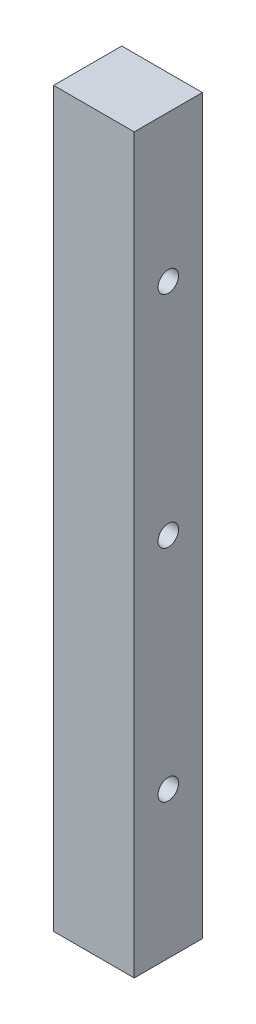
ISO-10303-21;
HEADER;
FILE_DESCRIPTION(('STEP AP214'),'2;1');
FILE_NAME('part.step','',(''),(''),'','','');
FILE_SCHEMA(('AUTOMOTIVE_DESIGN { 1 0 10303 214 1 1 1 1 }'));
ENDSEC;
DATA;
#1=APPLICATION_CONTEXT('core data for automotive mechanical design processes');
#2=APPLICATION_PROTOCOL_DEFINITION('international standard','automotive_design',2000,#1);
#3=PRODUCT_CONTEXT('',#1,'mechanical');
#4=PRODUCT('Part','Part','',(#3));
#5=PRODUCT_RELATED_PRODUCT_CATEGORY('part','',(#4));
#6=PRODUCT_DEFINITION_FORMATION('','',#4);
#7=PRODUCT_DEFINITION_CONTEXT('part definition',#1,'design');
#8=PRODUCT_DEFINITION('design','',#6,#7);
#9=PRODUCT_DEFINITION_SHAPE('','',#8);
#10=(LENGTH_UNIT() NAMED_UNIT(*) SI_UNIT(.MILLI.,.METRE.));
#11=(NAMED_UNIT(*) PLANE_ANGLE_UNIT() SI_UNIT($,.RADIAN.));
#12=(NAMED_UNIT(*) SI_UNIT($,.STERADIAN.) SOLID_ANGLE_UNIT());
#13=UNCERTAINTY_MEASURE_WITH_UNIT(LENGTH_MEASURE(1.E-05),#10,'distance_accuracy_value','');
#14=(GEOMETRIC_REPRESENTATION_CONTEXT(3) GLOBAL_UNCERTAINTY_ASSIGNED_CONTEXT((#13)) GLOBAL_UNIT_ASSIGNED_CONTEXT((#10,
#11,#12)) REPRESENTATION_CONTEXT('',''));
#15=CARTESIAN_POINT('',(0.,0.,0.));
#16=DIRECTION('',(0.,0.,1.));
#17=DIRECTION('',(1.,0.,0.));
#18=AXIS2_PLACEMENT_3D('',#15,#16,#17);
#19=CARTESIAN_POINT('',(0.,0.,11.811));
#20=DIRECTION('',(1.,0.,0.));
#21=DIRECTION('',(0.,0.,-1.));
#22=AXIS2_PLACEMENT_3D('',#19,#20,#21);
#23=PLANE('',#22);
#24=CARTESIAN_POINT('',(0.,25.4,5.90550000000001));
#25=DIRECTION('',(-1.,0.,0.));
#26=DIRECTION('',(0.,0.,1.));
#27=AXIS2_PLACEMENT_3D('',#24,#25,#26);
#28=CIRCLE('',#27,1.778);
#29=CARTESIAN_POINT('',(0.,25.4,7.68350000000001));
#30=VERTEX_POINT('',#29);
#31=EDGE_CURVE('E121',#30,#30,#28,.T.);
#32=ORIENTED_EDGE('',*,*,#31,.F.);
#33=EDGE_LOOP('',(#32));
#34=FACE_BOUND('',#33,.T.);
#35=CARTESIAN_POINT('',(0.,63.5,5.90550000000001));
#36=DIRECTION('',(-1.,0.,0.));
#37=DIRECTION('',(0.,0.,1.));
#38=AXIS2_PLACEMENT_3D('',#35,#36,#37);
#39=CIRCLE('',#38,1.778);
#40=CARTESIAN_POINT('',(0.,63.5,7.68350000000001));
#41=VERTEX_POINT('',#40);
#42=EDGE_CURVE('E115',#41,#41,#39,.T.);
#43=ORIENTED_EDGE('',*,*,#42,.F.);
#44=EDGE_LOOP('',(#43));
#45=FACE_BOUND('',#44,.T.);
#46=CARTESIAN_POINT('',(0.,101.6,5.9055));
#47=DIRECTION('',(-1.,0.,0.));
#48=DIRECTION('',(0.,0.,1.));
#49=AXIS2_PLACEMENT_3D('',#46,#47,#48);
#50=CIRCLE('',#49,1.778);
#51=CARTESIAN_POINT('',(0.,101.6,7.6835));
#52=VERTEX_POINT('',#51);
#53=EDGE_CURVE('E109',#52,#52,#50,.T.);
#54=ORIENTED_EDGE('',*,*,#53,.F.);
#55=EDGE_LOOP('',(#54));
#56=FACE_BOUND('',#55,.T.);
#57=DIRECTION('',(0.,-1.,0.));
#58=VECTOR('',#57,1.);
#59=CARTESIAN_POINT('',(0.,0.,0.));
#60=LINE('',#59,#58);
#61=CARTESIAN_POINT('',(0.,127.,0.));
#62=VERTEX_POINT('',#61);
#63=CARTESIAN_POINT('',(0.,0.,0.));
#64=VERTEX_POINT('',#63);
#65=EDGE_CURVE('E95',#62,#64,#60,.T.);
#66=ORIENTED_EDGE('',*,*,#65,.T.);
#67=DIRECTION('',(0.,0.,-1.));
#68=VECTOR('',#67,1.);
#69=CARTESIAN_POINT('',(0.,0.,11.811));
#70=LINE('',#69,#68);
#71=CARTESIAN_POINT('',(0.,0.,11.811));
#72=VERTEX_POINT('',#71);
#73=EDGE_CURVE('E11',#72,#64,#70,.T.);
#74=ORIENTED_EDGE('',*,*,#73,.F.);
#75=DIRECTION('',(0.,-1.,0.));
#76=VECTOR('',#75,1.);
#77=CARTESIAN_POINT('',(0.,0.,11.811));
#78=LINE('',#77,#76);
#79=CARTESIAN_POINT('',(0.,127.,11.811));
#80=VERTEX_POINT('',#79);
#81=EDGE_CURVE('E83',#80,#72,#78,.T.);
#82=ORIENTED_EDGE('',*,*,#81,.F.);
#83=DIRECTION('',(0.,0.,-1.));
#84=VECTOR('',#83,1.);
#85=CARTESIAN_POINT('',(0.,127.,11.811));
#86=LINE('',#85,#84);
#87=EDGE_CURVE('E91',#80,#62,#86,.T.);
#88=ORIENTED_EDGE('',*,*,#87,.T.);
#89=EDGE_LOOP('',(#66,#74,#82,#88));
#90=FACE_BOUND('',#89,.T.);
#91=ADVANCED_FACE('F32',(#34,#45,#56,#90),#23,.F.);
#92=CARTESIAN_POINT('',(0.,0.,11.811));
#93=DIRECTION('',(0.,1.,0.));
#94=DIRECTION('',(0.,0.,1.));
#95=AXIS2_PLACEMENT_3D('',#92,#93,#94);
#96=PLANE('',#95);
#97=DIRECTION('',(1.,0.,0.));
#98=VECTOR('',#97,1.);
#99=CARTESIAN_POINT('',(0.,0.,0.));
#100=LINE('',#99,#98);
#101=CARTESIAN_POINT('',(13.97,0.,0.));
#102=VERTEX_POINT('',#101);
#103=EDGE_CURVE('E87',#64,#102,#100,.T.);
#104=ORIENTED_EDGE('',*,*,#103,.T.);
#105=DIRECTION('',(0.,0.,-1.));
#106=VECTOR('',#105,1.);
#107=CARTESIAN_POINT('',(13.97,0.,11.811));
#108=LINE('',#107,#106);
#109=CARTESIAN_POINT('',(13.97,0.,11.811));
#110=VERTEX_POINT('',#109);
#111=EDGE_CURVE('E40',#110,#102,#108,.T.);
#112=ORIENTED_EDGE('',*,*,#111,.F.);
#113=DIRECTION('',(1.,0.,0.));
#114=VECTOR('',#113,1.);
#115=CARTESIAN_POINT('',(0.,0.,11.811));
#116=LINE('',#115,#114);
#117=EDGE_CURVE('E78',#72,#110,#116,.T.);
#118=ORIENTED_EDGE('',*,*,#117,.F.);
#119=ORIENTED_EDGE('',*,*,#73,.T.);
#120=EDGE_LOOP('',(#104,#112,#118,#119));
#121=FACE_BOUND('',#120,.T.);
#122=ADVANCED_FACE('F86',(#121),#96,.F.);
#123=CARTESIAN_POINT('',(13.97,0.,11.811));
#124=DIRECTION('',(-1.,0.,0.));
#125=DIRECTION('',(0.,0.,1.));
#126=AXIS2_PLACEMENT_3D('',#123,#124,#125);
#127=PLANE('',#126);
#128=CARTESIAN_POINT('',(13.97,25.4,5.90550000000001));
#129=DIRECTION('',(-1.,0.,0.));
#130=DIRECTION('',(0.,0.,1.));
#131=AXIS2_PLACEMENT_3D('',#128,#129,#130);
#132=CIRCLE('',#131,1.778);
#133=CARTESIAN_POINT('',(13.97,25.4,7.68350000000001));
#134=VERTEX_POINT('',#133);
#135=EDGE_CURVE('E118',#134,#134,#132,.T.);
#136=ORIENTED_EDGE('',*,*,#135,.T.);
#137=EDGE_LOOP('',(#136));
#138=FACE_BOUND('',#137,.T.);
#139=CARTESIAN_POINT('',(13.97,63.5,5.90550000000001));
#140=DIRECTION('',(-1.,0.,0.));
#141=DIRECTION('',(0.,0.,1.));
#142=AXIS2_PLACEMENT_3D('',#139,#140,#141);
#143=CIRCLE('',#142,1.778);
#144=CARTESIAN_POINT('',(13.97,63.5,7.68350000000001));
#145=VERTEX_POINT('',#144);
#146=EDGE_CURVE('E112',#145,#145,#143,.T.);
#147=ORIENTED_EDGE('',*,*,#146,.T.);
#148=EDGE_LOOP('',(#147));
#149=FACE_BOUND('',#148,.T.);
#150=CARTESIAN_POINT('',(13.97,101.6,5.9055));
#151=DIRECTION('',(-1.,0.,0.));
#152=DIRECTION('',(0.,0.,1.));
#153=AXIS2_PLACEMENT_3D('',#150,#151,#152);
#154=CIRCLE('',#153,1.778);
#155=CARTESIAN_POINT('',(13.97,101.6,7.6835));
#156=VERTEX_POINT('',#155);
#157=EDGE_CURVE('E98',#156,#156,#154,.T.);
#158=ORIENTED_EDGE('',*,*,#157,.T.);
#159=EDGE_LOOP('',(#158));
#160=FACE_BOUND('',#159,.T.);
#161=DIRECTION('',(0.,1.,0.));
#162=VECTOR('',#161,1.);
#163=CARTESIAN_POINT('',(13.97,0.,0.));
#164=LINE('',#163,#162);
#165=CARTESIAN_POINT('',(13.97,127.,0.));
#166=VERTEX_POINT('',#165);
#167=EDGE_CURVE('E65',#102,#166,#164,.T.);
#168=ORIENTED_EDGE('',*,*,#167,.T.);
#169=DIRECTION('',(0.,0.,-1.));
#170=VECTOR('',#169,1.);
#171=CARTESIAN_POINT('',(13.97,127.,11.811));
#172=LINE('',#171,#170);
#173=CARTESIAN_POINT('',(13.97,127.,11.811));
#174=VERTEX_POINT('',#173);
#175=EDGE_CURVE('E88',#174,#166,#172,.T.);
#176=ORIENTED_EDGE('',*,*,#175,.F.);
#177=DIRECTION('',(0.,1.,0.));
#178=VECTOR('',#177,1.);
#179=CARTESIAN_POINT('',(13.97,0.,11.811));
#180=LINE('',#179,#178);
#181=EDGE_CURVE('E81',#110,#174,#180,.T.);
#182=ORIENTED_EDGE('',*,*,#181,.F.);
#183=ORIENTED_EDGE('',*,*,#111,.T.);
#184=EDGE_LOOP('',(#168,#176,#182,#183));
#185=FACE_BOUND('',#184,.T.);
#186=ADVANCED_FACE('F89',(#138,#149,#160,#185),#127,.F.);
#187=CARTESIAN_POINT('',(0.,127.,11.811));
#188=DIRECTION('',(0.,-1.,0.));
#189=DIRECTION('',(0.,0.,-1.));
#190=AXIS2_PLACEMENT_3D('',#187,#188,#189);
#191=PLANE('',#190);
#192=DIRECTION('',(-1.,0.,0.));
#193=VECTOR('',#192,1.);
#194=CARTESIAN_POINT('',(0.,127.,0.));
#195=LINE('',#194,#193);
#196=EDGE_CURVE('E71',#166,#62,#195,.T.);
#197=ORIENTED_EDGE('',*,*,#196,.T.);
#198=ORIENTED_EDGE('',*,*,#87,.F.);
#199=DIRECTION('',(-1.,0.,0.));
#200=VECTOR('',#199,1.);
#201=CARTESIAN_POINT('',(0.,127.,11.811));
#202=LINE('',#201,#200);
#203=EDGE_CURVE('E48',#174,#80,#202,.T.);
#204=ORIENTED_EDGE('',*,*,#203,.F.);
#205=ORIENTED_EDGE('',*,*,#175,.T.);
#206=EDGE_LOOP('',(#197,#198,#204,#205));
#207=FACE_BOUND('',#206,.T.);
#208=ADVANCED_FACE('F103',(#207),#191,.F.);
#209=CARTESIAN_POINT('',(0.,0.,11.811));
#210=DIRECTION('',(0.,0.,-1.));
#211=DIRECTION('',(-1.,0.,0.));
#212=AXIS2_PLACEMENT_3D('',#209,#210,#211);
#213=PLANE('',#212);
#214=ORIENTED_EDGE('',*,*,#81,.T.);
#215=ORIENTED_EDGE('',*,*,#117,.T.);
#216=ORIENTED_EDGE('',*,*,#181,.T.);
#217=ORIENTED_EDGE('',*,*,#203,.T.);
#218=EDGE_LOOP('',(#214,#215,#216,#217));
#219=FACE_BOUND('',#218,.T.);
#220=ADVANCED_FACE('F79',(#219),#213,.F.);
#221=CARTESIAN_POINT('',(0.,0.,0.));
#222=DIRECTION('',(0.,0.,-1.));
#223=DIRECTION('',(-1.,0.,0.));
#224=AXIS2_PLACEMENT_3D('',#221,#222,#223);
#225=PLANE('',#224);
#226=ORIENTED_EDGE('',*,*,#65,.F.);
#227=ORIENTED_EDGE('',*,*,#196,.F.);
#228=ORIENTED_EDGE('',*,*,#167,.F.);
#229=ORIENTED_EDGE('',*,*,#103,.F.);
#230=EDGE_LOOP('',(#226,#227,#228,#229));
#231=FACE_BOUND('',#230,.T.);
#232=ADVANCED_FACE('F106',(#231),#225,.T.);
#233=CARTESIAN_POINT('',(13.97,101.6,5.9055));
#234=DIRECTION('',(-1.,0.,0.));
#235=DIRECTION('',(0.,0.,1.));
#236=AXIS2_PLACEMENT_3D('',#233,#234,#235);
#237=CYLINDRICAL_SURFACE('',#236,1.778);
#238=ORIENTED_EDGE('',*,*,#157,.F.);
#239=EDGE_LOOP('',(#238));
#240=FACE_BOUND('',#239,.T.);
#241=ORIENTED_EDGE('',*,*,#53,.T.);
#242=EDGE_LOOP('',(#241));
#243=FACE_BOUND('',#242,.T.);
#244=ADVANCED_FACE('F142',(#240,#243),#237,.F.);
#245=CARTESIAN_POINT('',(13.97,63.5,5.90550000000001));
#246=DIRECTION('',(-1.,0.,0.));
#247=DIRECTION('',(0.,0.,1.));
#248=AXIS2_PLACEMENT_3D('',#245,#246,#247);
#249=CYLINDRICAL_SURFACE('',#248,1.778);
#250=ORIENTED_EDGE('',*,*,#146,.F.);
#251=EDGE_LOOP('',(#250));
#252=FACE_BOUND('',#251,.T.);
#253=ORIENTED_EDGE('',*,*,#42,.T.);
#254=EDGE_LOOP('',(#253));
#255=FACE_BOUND('',#254,.T.);
#256=ADVANCED_FACE('F132',(#252,#255),#249,.F.);
#257=CARTESIAN_POINT('',(13.97,25.4,5.90550000000001));
#258=DIRECTION('',(-1.,0.,0.));
#259=DIRECTION('',(0.,0.,1.));
#260=AXIS2_PLACEMENT_3D('',#257,#258,#259);
#261=CYLINDRICAL_SURFACE('',#260,1.778);
#262=ORIENTED_EDGE('',*,*,#135,.F.);
#263=EDGE_LOOP('',(#262));
#264=FACE_BOUND('',#263,.T.);
#265=ORIENTED_EDGE('',*,*,#31,.T.);
#266=EDGE_LOOP('',(#265));
#267=FACE_BOUND('',#266,.T.);
#268=ADVANCED_FACE('F129',(#264,#267),#261,.F.);
#269=CLOSED_SHELL('',(#91,#122,#186,#208,#220,#232,#244,#256,#268));
#270=MANIFOLD_SOLID_BREP('B2',#269);
#271=ADVANCED_BREP_SHAPE_REPRESENTATION('',(#18,#270),#14);
#272=SHAPE_DEFINITION_REPRESENTATION(#9,#271);
ENDSEC;
END-ISO-10303-21;
